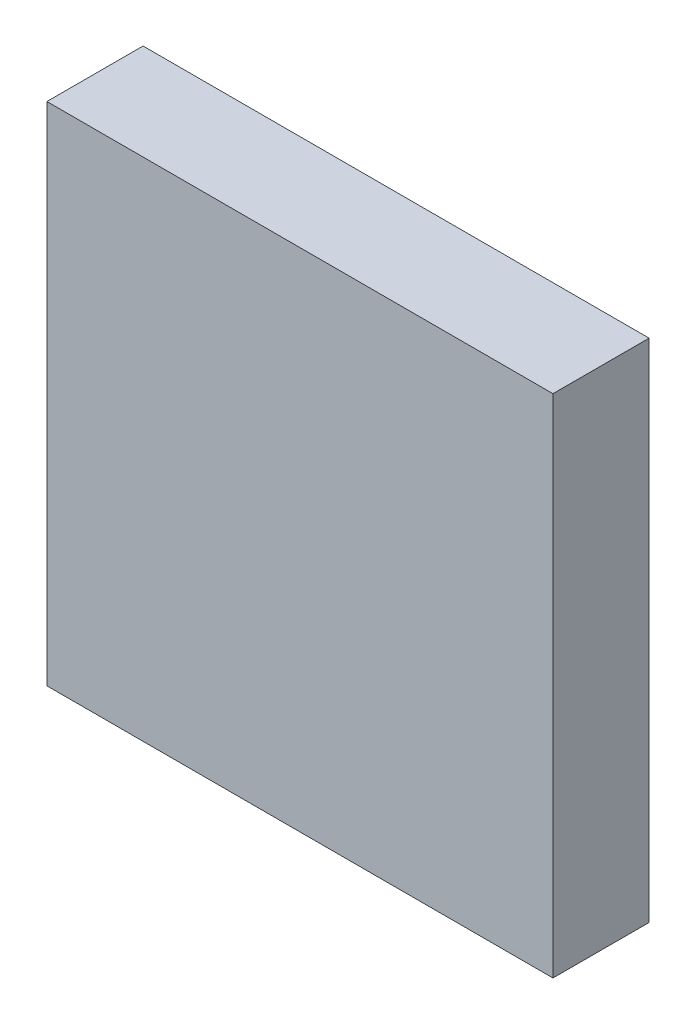
ISO-10303-21;
HEADER;
FILE_DESCRIPTION(('STEP AP214'),'2;1');
FILE_NAME('part.step','',(''),(''),'','','');
FILE_SCHEMA(('AUTOMOTIVE_DESIGN { 1 0 10303 214 1 1 1 1 }'));
ENDSEC;
DATA;
#1=APPLICATION_CONTEXT('core data for automotive mechanical design processes');
#2=APPLICATION_PROTOCOL_DEFINITION('international standard','automotive_design',2000,#1);
#3=PRODUCT_CONTEXT('',#1,'mechanical');
#4=PRODUCT('Part','Part','',(#3));
#5=PRODUCT_RELATED_PRODUCT_CATEGORY('part','',(#4));
#6=PRODUCT_DEFINITION_FORMATION('','',#4);
#7=PRODUCT_DEFINITION_CONTEXT('part definition',#1,'design');
#8=PRODUCT_DEFINITION('design','',#6,#7);
#9=PRODUCT_DEFINITION_SHAPE('','',#8);
#10=(LENGTH_UNIT() NAMED_UNIT(*) SI_UNIT(.MILLI.,.METRE.));
#11=(NAMED_UNIT(*) PLANE_ANGLE_UNIT() SI_UNIT($,.RADIAN.));
#12=(NAMED_UNIT(*) SI_UNIT($,.STERADIAN.) SOLID_ANGLE_UNIT());
#13=UNCERTAINTY_MEASURE_WITH_UNIT(LENGTH_MEASURE(1.E-05),#10,'distance_accuracy_value','');
#14=(GEOMETRIC_REPRESENTATION_CONTEXT(3) GLOBAL_UNCERTAINTY_ASSIGNED_CONTEXT((#13)) GLOBAL_UNIT_ASSIGNED_CONTEXT((#10,
#11,#12)) REPRESENTATION_CONTEXT('',''));
#15=CARTESIAN_POINT('',(0.,0.,0.));
#16=DIRECTION('',(0.,0.,1.));
#17=DIRECTION('',(1.,0.,0.));
#18=AXIS2_PLACEMENT_3D('',#15,#16,#17);
#19=CARTESIAN_POINT('',(0.,0.,0.95));
#20=DIRECTION('',(0.,0.,1.));
#21=DIRECTION('',(1.,0.,0.));
#22=AXIS2_PLACEMENT_3D('',#19,#20,#21);
#23=PLANE('',#22);
#24=DIRECTION('',(1.,0.,0.));
#25=VECTOR('',#24,1.);
#26=CARTESIAN_POINT('',(2.5,0.,0.95));
#27=LINE('',#26,#25);
#28=CARTESIAN_POINT('',(0.,0.,0.95));
#29=VERTEX_POINT('',#28);
#30=CARTESIAN_POINT('',(5.,0.,0.95));
#31=VERTEX_POINT('',#30);
#32=EDGE_CURVE('E77',#29,#31,#27,.T.);
#33=ORIENTED_EDGE('',*,*,#32,.T.);
#34=DIRECTION('',(0.,1.,0.));
#35=VECTOR('',#34,1.);
#36=CARTESIAN_POINT('',(5.,2.5,0.95));
#37=LINE('',#36,#35);
#38=CARTESIAN_POINT('',(5.,5.,0.95));
#39=VERTEX_POINT('',#38);
#40=EDGE_CURVE('E83',#31,#39,#37,.T.);
#41=ORIENTED_EDGE('',*,*,#40,.T.);
#42=DIRECTION('',(-1.,0.,0.));
#43=VECTOR('',#42,1.);
#44=CARTESIAN_POINT('',(2.5,5.,0.95));
#45=LINE('',#44,#43);
#46=CARTESIAN_POINT('',(0.,5.,0.95));
#47=VERTEX_POINT('',#46);
#48=EDGE_CURVE('E106',#39,#47,#45,.T.);
#49=ORIENTED_EDGE('',*,*,#48,.T.);
#50=DIRECTION('',(0.,-1.,0.));
#51=VECTOR('',#50,1.);
#52=CARTESIAN_POINT('',(0.,2.5,0.95));
#53=LINE('',#52,#51);
#54=EDGE_CURVE('E10',#47,#29,#53,.T.);
#55=ORIENTED_EDGE('',*,*,#54,.T.);
#56=EDGE_LOOP('',(#33,#41,#49,#55));
#57=FACE_BOUND('',#56,.T.);
#58=ADVANCED_FACE('F15',(#57),#23,.T.);
#59=CARTESIAN_POINT('',(0.,0.,0.));
#60=DIRECTION('',(0.,0.,1.));
#61=DIRECTION('',(1.,0.,0.));
#62=AXIS2_PLACEMENT_3D('',#59,#60,#61);
#63=PLANE('',#62);
#64=DIRECTION('',(0.,-1.,0.));
#65=VECTOR('',#64,1.);
#66=CARTESIAN_POINT('',(0.,2.5,0.));
#67=LINE('',#66,#65);
#68=CARTESIAN_POINT('',(0.,5.,0.));
#69=VERTEX_POINT('',#68);
#70=CARTESIAN_POINT('',(0.,0.,0.));
#71=VERTEX_POINT('',#70);
#72=EDGE_CURVE('E18',#69,#71,#67,.T.);
#73=ORIENTED_EDGE('',*,*,#72,.F.);
#74=DIRECTION('',(-1.,0.,0.));
#75=VECTOR('',#74,1.);
#76=CARTESIAN_POINT('',(2.5,5.,0.));
#77=LINE('',#76,#75);
#78=CARTESIAN_POINT('',(5.,5.,0.));
#79=VERTEX_POINT('',#78);
#80=EDGE_CURVE('E71',#79,#69,#77,.T.);
#81=ORIENTED_EDGE('',*,*,#80,.F.);
#82=DIRECTION('',(0.,1.,0.));
#83=VECTOR('',#82,1.);
#84=CARTESIAN_POINT('',(5.,2.5,0.));
#85=LINE('',#84,#83);
#86=CARTESIAN_POINT('',(5.,0.,0.));
#87=VERTEX_POINT('',#86);
#88=EDGE_CURVE('E64',#87,#79,#85,.T.);
#89=ORIENTED_EDGE('',*,*,#88,.F.);
#90=DIRECTION('',(1.,0.,0.));
#91=VECTOR('',#90,1.);
#92=CARTESIAN_POINT('',(2.5,0.,0.));
#93=LINE('',#92,#91);
#94=EDGE_CURVE('E68',#71,#87,#93,.T.);
#95=ORIENTED_EDGE('',*,*,#94,.F.);
#96=EDGE_LOOP('',(#73,#81,#89,#95));
#97=FACE_BOUND('',#96,.T.);
#98=ADVANCED_FACE('F66',(#97),#63,.F.);
#99=CARTESIAN_POINT('',(0.,5.,0.));
#100=DIRECTION('',(-1.,0.,0.));
#101=DIRECTION('',(0.,0.,1.));
#102=AXIS2_PLACEMENT_3D('',#99,#100,#101);
#103=PLANE('',#102);
#104=DIRECTION('',(0.,0.,1.));
#105=VECTOR('',#104,1.);
#106=CARTESIAN_POINT('',(0.,5.,0.475));
#107=LINE('',#106,#105);
#108=EDGE_CURVE('E101',#69,#47,#107,.T.);
#109=ORIENTED_EDGE('',*,*,#108,.F.);
#110=ORIENTED_EDGE('',*,*,#72,.T.);
#111=DIRECTION('',(0.,0.,1.));
#112=VECTOR('',#111,1.);
#113=CARTESIAN_POINT('',(0.,0.,0.475));
#114=LINE('',#113,#112);
#115=EDGE_CURVE('E90',#71,#29,#114,.T.);
#116=ORIENTED_EDGE('',*,*,#115,.T.);
#117=ORIENTED_EDGE('',*,*,#54,.F.);
#118=EDGE_LOOP('',(#109,#110,#116,#117));
#119=FACE_BOUND('',#118,.T.);
#120=ADVANCED_FACE('F157',(#119),#103,.T.);
#121=CARTESIAN_POINT('',(5.,5.,0.));
#122=DIRECTION('',(0.,1.,0.));
#123=DIRECTION('',(1.,0.,0.));
#124=AXIS2_PLACEMENT_3D('',#121,#122,#123);
#125=PLANE('',#124);
#126=DIRECTION('',(0.,0.,1.));
#127=VECTOR('',#126,1.);
#128=CARTESIAN_POINT('',(5.,5.,0.475));
#129=LINE('',#128,#127);
#130=EDGE_CURVE('E76',#79,#39,#129,.T.);
#131=ORIENTED_EDGE('',*,*,#130,.F.);
#132=ORIENTED_EDGE('',*,*,#80,.T.);
#133=ORIENTED_EDGE('',*,*,#108,.T.);
#134=ORIENTED_EDGE('',*,*,#48,.F.);
#135=EDGE_LOOP('',(#131,#132,#133,#134));
#136=FACE_BOUND('',#135,.T.);
#137=ADVANCED_FACE('F113',(#136),#125,.T.);
#138=CARTESIAN_POINT('',(5.,0.,0.));
#139=DIRECTION('',(1.,0.,0.));
#140=DIRECTION('',(0.,1.,0.));
#141=AXIS2_PLACEMENT_3D('',#138,#139,#140);
#142=PLANE('',#141);
#143=DIRECTION('',(0.,0.,1.));
#144=VECTOR('',#143,1.);
#145=CARTESIAN_POINT('',(5.,0.,0.475));
#146=LINE('',#145,#144);
#147=EDGE_CURVE('E80',#87,#31,#146,.T.);
#148=ORIENTED_EDGE('',*,*,#147,.F.);
#149=ORIENTED_EDGE('',*,*,#88,.T.);
#150=ORIENTED_EDGE('',*,*,#130,.T.);
#151=ORIENTED_EDGE('',*,*,#40,.F.);
#152=EDGE_LOOP('',(#148,#149,#150,#151));
#153=FACE_BOUND('',#152,.T.);
#154=ADVANCED_FACE('F81',(#153),#142,.T.);
#155=CARTESIAN_POINT('',(0.,0.,0.));
#156=DIRECTION('',(0.,-1.,0.));
#157=DIRECTION('',(0.,0.,-1.));
#158=AXIS2_PLACEMENT_3D('',#155,#156,#157);
#159=PLANE('',#158);
#160=ORIENTED_EDGE('',*,*,#115,.F.);
#161=ORIENTED_EDGE('',*,*,#94,.T.);
#162=ORIENTED_EDGE('',*,*,#147,.T.);
#163=ORIENTED_EDGE('',*,*,#32,.F.);
#164=EDGE_LOOP('',(#160,#161,#162,#163));
#165=FACE_BOUND('',#164,.T.);
#166=ADVANCED_FACE('F89',(#165),#159,.T.);
#167=CLOSED_SHELL('',(#58,#98,#120,#137,#154,#166));
#168=MANIFOLD_SOLID_BREP('B1',#167);
#169=ADVANCED_BREP_SHAPE_REPRESENTATION('',(#18,#168),#14);
#170=SHAPE_DEFINITION_REPRESENTATION(#9,#169);
ENDSEC;
END-ISO-10303-21;
